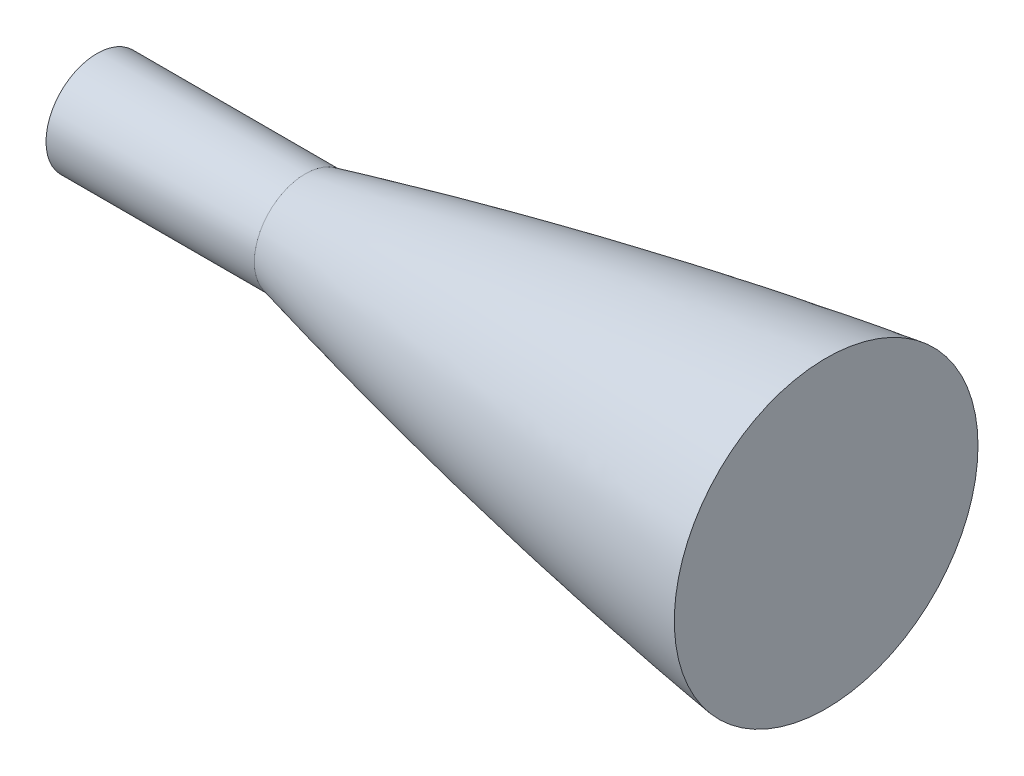
ISO-10303-21;
HEADER;
FILE_DESCRIPTION(('STEP AP214'),'2;1');
FILE_NAME('part.step','',(''),(''),'','','');
FILE_SCHEMA(('AUTOMOTIVE_DESIGN { 1 0 10303 214 1 1 1 1 }'));
ENDSEC;
DATA;
#1=APPLICATION_CONTEXT('core data for automotive mechanical design processes');
#2=APPLICATION_PROTOCOL_DEFINITION('international standard','automotive_design',2000,#1);
#3=PRODUCT_CONTEXT('',#1,'mechanical');
#4=PRODUCT('Part','Part','',(#3));
#5=PRODUCT_RELATED_PRODUCT_CATEGORY('part','',(#4));
#6=PRODUCT_DEFINITION_FORMATION('','',#4);
#7=PRODUCT_DEFINITION_CONTEXT('part definition',#1,'design');
#8=PRODUCT_DEFINITION('design','',#6,#7);
#9=PRODUCT_DEFINITION_SHAPE('','',#8);
#10=(LENGTH_UNIT() NAMED_UNIT(*) SI_UNIT(.MILLI.,.METRE.));
#11=(NAMED_UNIT(*) PLANE_ANGLE_UNIT() SI_UNIT($,.RADIAN.));
#12=(NAMED_UNIT(*) SI_UNIT($,.STERADIAN.) SOLID_ANGLE_UNIT());
#13=UNCERTAINTY_MEASURE_WITH_UNIT(LENGTH_MEASURE(1.E-05),#10,'distance_accuracy_value','');
#14=(GEOMETRIC_REPRESENTATION_CONTEXT(3) GLOBAL_UNCERTAINTY_ASSIGNED_CONTEXT((#13)) GLOBAL_UNIT_ASSIGNED_CONTEXT((#10,
#11,#12)) REPRESENTATION_CONTEXT('',''));
#15=CARTESIAN_POINT('',(0.,0.,0.));
#16=DIRECTION('',(0.,0.,1.));
#17=DIRECTION('',(1.,0.,0.));
#18=AXIS2_PLACEMENT_3D('',#15,#16,#17);
#19=CARTESIAN_POINT('',(355.600000087303,0.,-50.7999999734738));
#20=CARTESIAN_POINT('',(355.162608624885,0.,-50.7999999735659));
#21=CARTESIAN_POINT('',(354.282013928467,0.,-50.7994231748212));
#22=CARTESIAN_POINT('',(352.40570494871,0.,-50.7968275800228));
#23=CARTESIAN_POINT('',(350.344714481144,0.,-50.7899060027044));
#24=CARTESIAN_POINT('',(348.272494467081,0.,-50.7795236600886));
#25=CARTESIAN_POINT('',(346.163273231363,0.,-50.7656805804724));
#26=CARTESIAN_POINT('',(344.069774299166,0.,-50.748376801568));
#27=CARTESIAN_POINT('',(341.973247657925,0.,-50.7276123705328));
#28=CARTESIAN_POINT('',(339.329601827273,0.,-50.6970642265401));
#29=CARTESIAN_POINT('',(336.139078074932,0.,-50.6530928887572));
#30=CARTESIAN_POINT('',(332.401425999425,0.,-50.5911161036849));
#31=CARTESIAN_POINT('',(328.11696662755,0.,-50.5056092089642));
#32=CARTESIAN_POINT('',(323.832782668936,0.,-50.4056458049246));
#33=CARTESIAN_POINT('',(319.548981494171,0.,-50.2912270295979));
#34=CARTESIAN_POINT('',(315.265578413362,0.,-50.1623541856019));
#35=CARTESIAN_POINT('',(308.841173655417,0.,-49.9473660179873));
#36=CARTESIAN_POINT('',(299.206459448119,0.,-49.5706926353229));
#37=CARTESIAN_POINT('',(262.82240565497,0.,-47.8202304215008));
#38=CARTESIAN_POINT('',(219.035004800648,0.,-44.081341124365));
#39=CARTESIAN_POINT('',(168.000757519809,0.,-37.5160414552513));
#40=CARTESIAN_POINT('',(119.48562917264,0.,-28.8169974598621));
#41=CARTESIAN_POINT('',(97.4339898112845,0.,-24.3488229238283));
#42=CARTESIAN_POINT('',(82.7791362290027,0.,-21.1556615214593));
#43=CARTESIAN_POINT('',(77.5504414103591,0.,-19.9917100931957));
#44=CARTESIAN_POINT('',(73.3706786134794,0.,-19.0464466097069));
#45=CARTESIAN_POINT('',(69.7273952025031,0.,-18.2095760773824));
#46=CARTESIAN_POINT('',(66.6195661782511,0.,-17.4865360850931));
#47=CARTESIAN_POINT('',(64.0458560302311,0.,-16.881716673034));
#48=CARTESIAN_POINT('',(62.0056186070266,0.,-16.3987071516188));
#49=CARTESIAN_POINT('',(59.9691674563714,0.,-15.9130688516041));
#50=CARTESIAN_POINT('',(57.9182040289449,0.,-15.4202778528841));
#51=CARTESIAN_POINT('',(55.9042897804765,0.,-14.9330814332139));
#52=CARTESIAN_POINT('',(53.9013161125411,0.,-14.4450248471193));
#53=CARTESIAN_POINT('',(52.0797481244347,0.,-13.9973601803948));
#54=CARTESIAN_POINT('',(51.224607869347,0.,-13.7865417030788));
#55=CARTESIAN_POINT('',(50.8000000794835,0.,-13.6815677480592));
#56=B_SPLINE_CURVE_WITH_KNOTS('',4,(#19,#20,#21,#22,#23,#24,#25,#26,#27,#28,#29,#30,#31,#32,#33,
#34,#35,#36,#37,#38,#39,#40,#41,#42,#43,#44,#45,#46,#47,#48,#49,#50,#51,#52,#53,#54,#55),
.UNSPECIFIED.,.F.,.F.,(5,1,1,1,1,1,1,1,1,1,1,1,1,1,1,1,1,1,1,1,1,1,1,1,1,1,1,1,1,1,1,1,1,5),
(0.0828265796694398,0.0885105936404642,0.0941946077216388,0.0998786218028135,0.105562635883988,
0.111246649965163,0.116930664046338,0.122614678127512,0.128298692208687,0.139917178769152,
0.151535665329618,0.163154151890083,0.174772638450548,0.186391125129919,0.198009611809289,
0.20962809848866,0.244483558329257,0.290957504236502,0.593038155059935,0.685986046686238,
0.802170914093339,0.825407884941349,0.837026372593241,0.848644860245132,0.860263347897024,
0.871881835548916,0.877565849853662,0.883249864158408,0.888933878463154,0.8946178927679,
0.900301907072646,0.905985921377392,0.911669935682138,0.917353950101889),.UNSPECIFIED.);
#57=CARTESIAN_POINT('',(355.600000053401,0.,-1.26999997329437));
#58=DIRECTION('',(1.,0.,0.));
#59=AXIS1_PLACEMENT('',#57,#58);
#60=SURFACE_OF_REVOLUTION('',#56,#59);
#61=CARTESIAN_POINT('',(50.8000000630173,0.,-1.26999997329433));
#62=DIRECTION('',(-1.,0.,0.));
#63=DIRECTION('',(0.,0.,1.));
#64=AXIS2_PLACEMENT_3D('',#61,#62,#63);
#65=CIRCLE('',#64,12.4115677747649);
#66=CARTESIAN_POINT('',(50.8000000630173,0.,11.1415678014705));
#67=VERTEX_POINT('',#66);
#68=EDGE_CURVE('E42',#67,#67,#65,.T.);
#69=ORIENTED_EDGE('',*,*,#68,.F.);
#70=EDGE_LOOP('',(#69));
#71=FACE_BOUND('',#70,.T.);
#72=CARTESIAN_POINT('',(177.800000053401,0.,-1.26999997329435));
#73=DIRECTION('',(1.,0.,0.));
#74=DIRECTION('',(0.,0.,-1.));
#75=AXIS2_PLACEMENT_3D('',#72,#73,#74);
#76=CIRCLE('',#75,37.0224088166855);
#77=CARTESIAN_POINT('',(177.800000053401,0.,-38.2924087899798));
#78=VERTEX_POINT('',#77);
#79=EDGE_CURVE('E39',#78,#78,#76,.F.);
#80=ORIENTED_EDGE('',*,*,#79,.T.);
#81=EDGE_LOOP('',(#80));
#82=FACE_BOUND('',#81,.T.);
#83=ADVANCED_FACE('F35',(#71,#82),#60,.F.);
#84=CARTESIAN_POINT('',(6.30172719562339E-08,0.,-1.26999997329433));
#85=DIRECTION('',(1.,0.,0.));
#86=DIRECTION('',(0.,0.,-1.));
#87=AXIS2_PLACEMENT_3D('',#84,#85,#86);
#88=CYLINDRICAL_SURFACE('',#87,12.4115677747649);
#89=CARTESIAN_POINT('',(6.30172719562339E-08,0.,-1.26999997329433));
#90=DIRECTION('',(-1.,0.,0.));
#91=DIRECTION('',(0.,0.,1.));
#92=AXIS2_PLACEMENT_3D('',#89,#90,#91);
#93=CIRCLE('',#92,12.4115677747649);
#94=CARTESIAN_POINT('',(6.30172734749632E-08,0.,11.1415678014705));
#95=VERTEX_POINT('',#94);
#96=EDGE_CURVE('E10',#95,#95,#93,.T.);
#97=ORIENTED_EDGE('',*,*,#96,.F.);
#98=EDGE_LOOP('',(#97));
#99=FACE_BOUND('',#98,.T.);
#100=ORIENTED_EDGE('',*,*,#68,.T.);
#101=EDGE_LOOP('',(#100));
#102=FACE_BOUND('',#101,.T.);
#103=ADVANCED_FACE('F67',(#99,#102),#88,.T.);
#104=CARTESIAN_POINT('',(6.30172719562339E-08,0.,-1.26999997329433));
#105=DIRECTION('',(-1.,0.,0.));
#106=DIRECTION('',(0.,0.,1.));
#107=AXIS2_PLACEMENT_3D('',#104,#105,#106);
#108=PLANE('',#107);
#109=ORIENTED_EDGE('',*,*,#96,.T.);
#110=EDGE_LOOP('',(#109));
#111=FACE_BOUND('',#110,.T.);
#112=ADVANCED_FACE('F62',(#111),#108,.T.);
#113=CARTESIAN_POINT('',(177.800000053401,0.,-1.26999997329435));
#114=DIRECTION('',(1.,0.,0.));
#115=DIRECTION('',(0.,0.,-1.));
#116=AXIS2_PLACEMENT_3D('',#113,#114,#115);
#117=PLANE('',#116);
#118=ORIENTED_EDGE('',*,*,#79,.F.);
#119=EDGE_LOOP('',(#118));
#120=FACE_BOUND('',#119,.T.);
#121=ADVANCED_FACE('F60',(#120),#117,.T.);
#122=CLOSED_SHELL('',(#83,#103,#112,#121));
#123=MANIFOLD_SOLID_BREP('B2',#122);
#124=ADVANCED_BREP_SHAPE_REPRESENTATION('',(#18,#123),#14);
#125=SHAPE_DEFINITION_REPRESENTATION(#9,#124);
ENDSEC;
END-ISO-10303-21;
